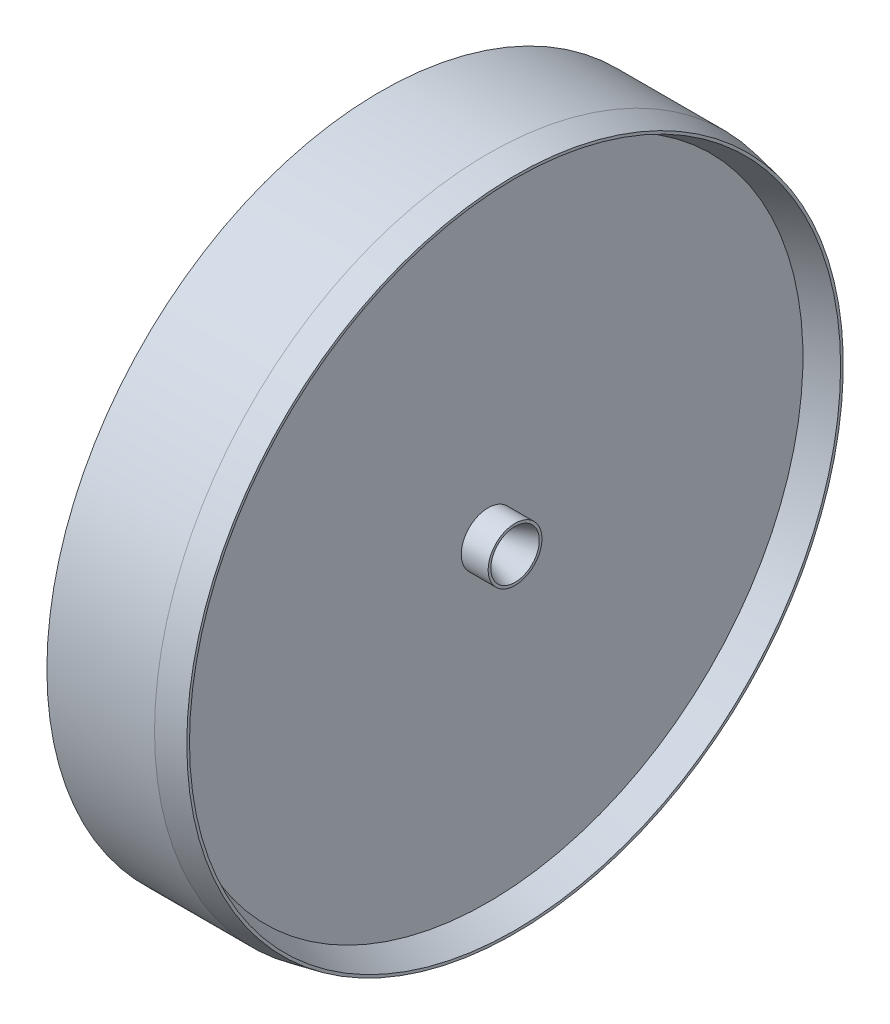
ISO-10303-21;
HEADER;
FILE_DESCRIPTION(('STEP AP214'),'2;1');
FILE_NAME('part.step','',(''),(''),'','','');
FILE_SCHEMA(('AUTOMOTIVE_DESIGN { 1 0 10303 214 1 1 1 1 }'));
ENDSEC;
DATA;
#1=APPLICATION_CONTEXT('core data for automotive mechanical design processes');
#2=APPLICATION_PROTOCOL_DEFINITION('international standard','automotive_design',2000,#1);
#3=PRODUCT_CONTEXT('',#1,'mechanical');
#4=PRODUCT('Part','Part','',(#3));
#5=PRODUCT_RELATED_PRODUCT_CATEGORY('part','',(#4));
#6=PRODUCT_DEFINITION_FORMATION('','',#4);
#7=PRODUCT_DEFINITION_CONTEXT('part definition',#1,'design');
#8=PRODUCT_DEFINITION('design','',#6,#7);
#9=PRODUCT_DEFINITION_SHAPE('','',#8);
#10=(LENGTH_UNIT() NAMED_UNIT(*) SI_UNIT(.MILLI.,.METRE.));
#11=(NAMED_UNIT(*) PLANE_ANGLE_UNIT() SI_UNIT($,.RADIAN.));
#12=(NAMED_UNIT(*) SI_UNIT($,.STERADIAN.) SOLID_ANGLE_UNIT());
#13=UNCERTAINTY_MEASURE_WITH_UNIT(LENGTH_MEASURE(1.E-05),#10,'distance_accuracy_value','');
#14=(GEOMETRIC_REPRESENTATION_CONTEXT(3) GLOBAL_UNCERTAINTY_ASSIGNED_CONTEXT((#13)) GLOBAL_UNIT_ASSIGNED_CONTEXT((#10,
#11,#12)) REPRESENTATION_CONTEXT('',''));
#15=CARTESIAN_POINT('',(0.,0.,0.));
#16=DIRECTION('',(0.,0.,1.));
#17=DIRECTION('',(1.,0.,0.));
#18=AXIS2_PLACEMENT_3D('',#15,#16,#17);
#19=CARTESIAN_POINT('',(3.99999999999999,0.,0.));
#20=DIRECTION('',(-1.,0.,0.));
#21=DIRECTION('',(0.,0.,1.));
#22=AXIS2_PLACEMENT_3D('',#19,#20,#21);
#23=PLANE('',#22);
#24=CARTESIAN_POINT('',(3.99999999999999,0.,0.));
#25=DIRECTION('',(-1.,0.,0.));
#26=DIRECTION('',(0.,0.,1.));
#27=AXIS2_PLACEMENT_3D('',#24,#25,#26);
#28=CIRCLE('',#27,0.5);
#29=CARTESIAN_POINT('',(3.99999999999999,0.,0.5));
#30=VERTEX_POINT('',#29);
#31=EDGE_CURVE('E10',#30,#30,#28,.T.);
#32=ORIENTED_EDGE('',*,*,#31,.F.);
#33=EDGE_LOOP('',(#32));
#34=FACE_BOUND('',#33,.T.);
#35=ADVANCED_FACE('F32',(#34),#23,.F.);
#36=CARTESIAN_POINT('',(3.99999999999999,0.,0.));
#37=DIRECTION('',(1.,0.,0.));
#38=DIRECTION('',(0.,0.,-1.));
#39=AXIS2_PLACEMENT_3D('',#36,#37,#38);
#40=CONICAL_SURFACE('',#39,0.5,0.380506377112365);
#41=CARTESIAN_POINT('',(4.99999999999999,0.,0.));
#42=DIRECTION('',(-1.,0.,0.));
#43=DIRECTION('',(0.,0.,1.));
#44=AXIS2_PLACEMENT_3D('',#41,#42,#43);
#45=CIRCLE('',#44,0.9);
#46=CARTESIAN_POINT('',(4.99999999999999,0.,0.9));
#47=VERTEX_POINT('',#46);
#48=EDGE_CURVE('E38',#47,#47,#45,.T.);
#49=ORIENTED_EDGE('',*,*,#48,.F.);
#50=EDGE_LOOP('',(#49));
#51=FACE_BOUND('',#50,.T.);
#52=ORIENTED_EDGE('',*,*,#31,.T.);
#53=EDGE_LOOP('',(#52));
#54=FACE_BOUND('',#53,.T.);
#55=ADVANCED_FACE('F107',(#51,#54),#40,.F.);
#56=CARTESIAN_POINT('',(4.99999999999999,0.9,0.));
#57=DIRECTION('',(-1.,0.,0.));
#58=DIRECTION('',(0.,0.,1.));
#59=AXIS2_PLACEMENT_3D('',#56,#57,#58);
#60=PLANE('',#59);
#61=CARTESIAN_POINT('',(4.99999999999999,0.,0.));
#62=DIRECTION('',(-1.,0.,0.));
#63=DIRECTION('',(0.,0.,1.));
#64=AXIS2_PLACEMENT_3D('',#61,#62,#63);
#65=CIRCLE('',#64,1.);
#66=CARTESIAN_POINT('',(4.99999999999999,0.,1.));
#67=VERTEX_POINT('',#66);
#68=EDGE_CURVE('E42',#67,#67,#65,.T.);
#69=ORIENTED_EDGE('',*,*,#68,.F.);
#70=EDGE_LOOP('',(#69));
#71=FACE_BOUND('',#70,.T.);
#72=ORIENTED_EDGE('',*,*,#48,.T.);
#73=EDGE_LOOP('',(#72));
#74=FACE_BOUND('',#73,.T.);
#75=ADVANCED_FACE('F102',(#71,#74),#60,.F.);
#76=CARTESIAN_POINT('',(0.,0.,0.));
#77=DIRECTION('',(-1.,0.,0.));
#78=DIRECTION('',(0.,0.,1.));
#79=AXIS2_PLACEMENT_3D('',#76,#77,#78);
#80=CYLINDRICAL_SURFACE('',#79,1.);
#81=CARTESIAN_POINT('',(3.99999999999999,0.,0.));
#82=DIRECTION('',(-1.,0.,0.));
#83=DIRECTION('',(0.,0.,1.));
#84=AXIS2_PLACEMENT_3D('',#81,#82,#83);
#85=CIRCLE('',#84,1.);
#86=CARTESIAN_POINT('',(3.99999999999999,0.,1.));
#87=VERTEX_POINT('',#86);
#88=EDGE_CURVE('E46',#87,#87,#85,.T.);
#89=ORIENTED_EDGE('',*,*,#88,.F.);
#90=EDGE_LOOP('',(#89));
#91=FACE_BOUND('',#90,.T.);
#92=ORIENTED_EDGE('',*,*,#68,.T.);
#93=EDGE_LOOP('',(#92));
#94=FACE_BOUND('',#93,.T.);
#95=ADVANCED_FACE('F96',(#91,#94),#80,.T.);
#96=CARTESIAN_POINT('',(3.99999999999999,1.,0.));
#97=DIRECTION('',(-1.,0.,0.));
#98=DIRECTION('',(0.,0.,1.));
#99=AXIS2_PLACEMENT_3D('',#96,#97,#98);
#100=PLANE('',#99);
#101=CARTESIAN_POINT('',(3.99999999999999,0.,0.));
#102=DIRECTION('',(-1.,0.,0.));
#103=DIRECTION('',(0.,0.,1.));
#104=AXIS2_PLACEMENT_3D('',#101,#102,#103);
#105=CIRCLE('',#104,11.7);
#106=CARTESIAN_POINT('',(3.99999999999999,0.,11.7));
#107=VERTEX_POINT('',#106);
#108=EDGE_CURVE('E51',#107,#107,#105,.T.);
#109=ORIENTED_EDGE('',*,*,#108,.F.);
#110=EDGE_LOOP('',(#109));
#111=FACE_BOUND('',#110,.T.);
#112=ORIENTED_EDGE('',*,*,#88,.T.);
#113=EDGE_LOOP('',(#112));
#114=FACE_BOUND('',#113,.T.);
#115=ADVANCED_FACE('F90',(#111,#114),#100,.F.);
#116=CARTESIAN_POINT('',(3.99999999999999,0.,0.));
#117=DIRECTION('',(1.,0.,0.));
#118=DIRECTION('',(0.,0.,-1.));
#119=AXIS2_PLACEMENT_3D('',#116,#117,#118);
#120=CONICAL_SURFACE('',#119,11.7,0.380506377112365);
#121=CARTESIAN_POINT('',(4.99999999999999,0.,0.));
#122=DIRECTION('',(-1.,0.,0.));
#123=DIRECTION('',(0.,0.,1.));
#124=AXIS2_PLACEMENT_3D('',#121,#122,#123);
#125=CIRCLE('',#124,12.1);
#126=CARTESIAN_POINT('',(4.99999999999999,0.,12.1));
#127=VERTEX_POINT('',#126);
#128=EDGE_CURVE('E54',#127,#127,#125,.T.);
#129=ORIENTED_EDGE('',*,*,#128,.F.);
#130=EDGE_LOOP('',(#129));
#131=FACE_BOUND('',#130,.T.);
#132=ORIENTED_EDGE('',*,*,#108,.T.);
#133=EDGE_LOOP('',(#132));
#134=FACE_BOUND('',#133,.T.);
#135=ADVANCED_FACE('F84',(#131,#134),#120,.F.);
#136=CARTESIAN_POINT('',(4.99999999999999,12.1,0.));
#137=DIRECTION('',(-1.,0.,0.));
#138=DIRECTION('',(0.,0.,1.));
#139=AXIS2_PLACEMENT_3D('',#136,#137,#138);
#140=PLANE('',#139);
#141=CARTESIAN_POINT('',(4.99999999999999,0.,0.));
#142=DIRECTION('',(-1.,0.,0.));
#143=DIRECTION('',(0.,0.,1.));
#144=AXIS2_PLACEMENT_3D('',#141,#142,#143);
#145=CIRCLE('',#144,12.2);
#146=CARTESIAN_POINT('',(4.99999999999999,0.,12.2));
#147=VERTEX_POINT('',#146);
#148=EDGE_CURVE('E57',#147,#147,#145,.T.);
#149=ORIENTED_EDGE('',*,*,#148,.F.);
#150=EDGE_LOOP('',(#149));
#151=FACE_BOUND('',#150,.T.);
#152=ORIENTED_EDGE('',*,*,#128,.T.);
#153=EDGE_LOOP('',(#152));
#154=FACE_BOUND('',#153,.T.);
#155=ADVANCED_FACE('F78',(#151,#154),#140,.F.);
#156=CARTESIAN_POINT('',(4.99999999999999,0.,0.));
#157=DIRECTION('',(-1.,0.,0.));
#158=DIRECTION('',(0.,0.,1.));
#159=AXIS2_PLACEMENT_3D('',#156,#157,#158);
#160=CONICAL_SURFACE('',#159,12.2,0.197395559849883);
#161=CARTESIAN_POINT('',(3.99999999999999,0.,0.));
#162=DIRECTION('',(-1.,0.,0.));
#163=DIRECTION('',(0.,0.,1.));
#164=AXIS2_PLACEMENT_3D('',#161,#162,#163);
#165=CIRCLE('',#164,12.4);
#166=CARTESIAN_POINT('',(3.99999999999999,0.,12.4));
#167=VERTEX_POINT('',#166);
#168=EDGE_CURVE('E60',#167,#167,#165,.T.);
#169=ORIENTED_EDGE('',*,*,#168,.F.);
#170=EDGE_LOOP('',(#169));
#171=FACE_BOUND('',#170,.T.);
#172=ORIENTED_EDGE('',*,*,#148,.T.);
#173=EDGE_LOOP('',(#172));
#174=FACE_BOUND('',#173,.T.);
#175=ADVANCED_FACE('F72',(#171,#174),#160,.T.);
#176=CARTESIAN_POINT('',(0.,0.,0.));
#177=DIRECTION('',(-1.,0.,0.));
#178=DIRECTION('',(0.,0.,1.));
#179=AXIS2_PLACEMENT_3D('',#176,#177,#178);
#180=CYLINDRICAL_SURFACE('',#179,12.4);
#181=CARTESIAN_POINT('',(0.,0.,0.));
#182=DIRECTION('',(-1.,0.,0.));
#183=DIRECTION('',(0.,0.,1.));
#184=AXIS2_PLACEMENT_3D('',#181,#182,#183);
#185=CIRCLE('',#184,12.4);
#186=CARTESIAN_POINT('',(0.,0.,12.4));
#187=VERTEX_POINT('',#186);
#188=EDGE_CURVE('E63',#187,#187,#185,.T.);
#189=ORIENTED_EDGE('',*,*,#188,.F.);
#190=EDGE_LOOP('',(#189));
#191=FACE_BOUND('',#190,.T.);
#192=ORIENTED_EDGE('',*,*,#168,.T.);
#193=EDGE_LOOP('',(#192));
#194=FACE_BOUND('',#193,.T.);
#195=ADVANCED_FACE('F69',(#191,#194),#180,.T.);
#196=CARTESIAN_POINT('',(0.,12.4,0.));
#197=DIRECTION('',(1.,0.,0.));
#198=DIRECTION('',(0.,0.,-1.));
#199=AXIS2_PLACEMENT_3D('',#196,#197,#198);
#200=PLANE('',#199);
#201=ORIENTED_EDGE('',*,*,#188,.T.);
#202=EDGE_LOOP('',(#201));
#203=FACE_BOUND('',#202,.T.);
#204=ADVANCED_FACE('F67',(#203),#200,.F.);
#205=CLOSED_SHELL('',(#35,#55,#75,#95,#115,#135,#155,#175,#195,#204));
#206=MANIFOLD_SOLID_BREP('B2',#205);
#207=ADVANCED_BREP_SHAPE_REPRESENTATION('',(#18,#206),#14);
#208=SHAPE_DEFINITION_REPRESENTATION(#9,#207);
ENDSEC;
END-ISO-10303-21;
